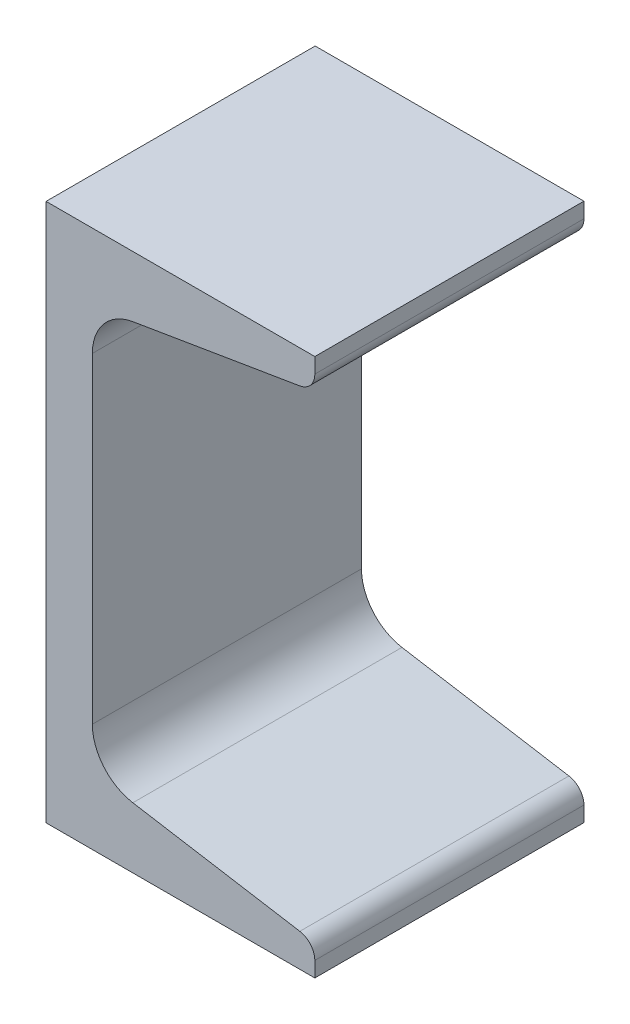
ISO-10303-21;
HEADER;
FILE_DESCRIPTION(('STEP AP214'),'2;1');
FILE_NAME('part.step','',(''),(''),'','','');
FILE_SCHEMA(('AUTOMOTIVE_DESIGN { 1 0 10303 214 1 1 1 1 }'));
ENDSEC;
DATA;
#1=APPLICATION_CONTEXT('core data for automotive mechanical design processes');
#2=APPLICATION_PROTOCOL_DEFINITION('international standard','automotive_design',2000,#1);
#3=PRODUCT_CONTEXT('',#1,'mechanical');
#4=PRODUCT('Part','Part','',(#3));
#5=PRODUCT_RELATED_PRODUCT_CATEGORY('part','',(#4));
#6=PRODUCT_DEFINITION_FORMATION('','',#4);
#7=PRODUCT_DEFINITION_CONTEXT('part definition',#1,'design');
#8=PRODUCT_DEFINITION('design','',#6,#7);
#9=PRODUCT_DEFINITION_SHAPE('','',#8);
#10=(LENGTH_UNIT() NAMED_UNIT(*) SI_UNIT(.MILLI.,.METRE.));
#11=(NAMED_UNIT(*) PLANE_ANGLE_UNIT() SI_UNIT($,.RADIAN.));
#12=(NAMED_UNIT(*) SI_UNIT($,.STERADIAN.) SOLID_ANGLE_UNIT());
#13=UNCERTAINTY_MEASURE_WITH_UNIT(LENGTH_MEASURE(1.E-05),#10,'distance_accuracy_value','');
#14=(GEOMETRIC_REPRESENTATION_CONTEXT(3) GLOBAL_UNCERTAINTY_ASSIGNED_CONTEXT((#13)) GLOBAL_UNIT_ASSIGNED_CONTEXT((#10,
#11,#12)) REPRESENTATION_CONTEXT('',''));
#15=CARTESIAN_POINT('',(0.,0.,0.));
#16=DIRECTION('',(0.,0.,1.));
#17=DIRECTION('',(1.,0.,0.));
#18=AXIS2_PLACEMENT_3D('',#15,#16,#17);
#19=CARTESIAN_POINT('',(0.,0.,19.05));
#20=DIRECTION('',(0.,1.,0.));
#21=DIRECTION('',(-1.,0.,0.));
#22=AXIS2_PLACEMENT_3D('',#19,#20,#21);
#23=PLANE('',#22);
#24=DIRECTION('',(1.,0.,0.));
#25=VECTOR('',#24,1.);
#26=CARTESIAN_POINT('',(0.,0.,-19.05));
#27=LINE('',#26,#25);
#28=CARTESIAN_POINT('',(0.,0.,-19.05));
#29=VERTEX_POINT('',#28);
#30=CARTESIAN_POINT('',(38.0492,0.,-19.05));
#31=VERTEX_POINT('',#30);
#32=EDGE_CURVE('E154',#29,#31,#27,.T.);
#33=ORIENTED_EDGE('',*,*,#32,.T.);
#34=DIRECTION('',(0.,0.,-1.));
#35=VECTOR('',#34,1.);
#36=CARTESIAN_POINT('',(38.0492,0.,19.05));
#37=LINE('',#36,#35);
#38=CARTESIAN_POINT('',(38.0492,0.,19.05));
#39=VERTEX_POINT('',#38);
#40=EDGE_CURVE('E11',#39,#31,#37,.T.);
#41=ORIENTED_EDGE('',*,*,#40,.F.);
#42=DIRECTION('',(1.,0.,0.));
#43=VECTOR('',#42,1.);
#44=CARTESIAN_POINT('',(0.,0.,19.05));
#45=LINE('',#44,#43);
#46=CARTESIAN_POINT('',(0.,0.,19.05));
#47=VERTEX_POINT('',#46);
#48=EDGE_CURVE('E176',#47,#39,#45,.T.);
#49=ORIENTED_EDGE('',*,*,#48,.F.);
#50=DIRECTION('',(0.,0.,-1.));
#51=VECTOR('',#50,1.);
#52=CARTESIAN_POINT('',(0.,0.,19.05));
#53=LINE('',#52,#51);
#54=EDGE_CURVE('E150',#47,#29,#53,.T.);
#55=ORIENTED_EDGE('',*,*,#54,.T.);
#56=EDGE_LOOP('',(#33,#41,#49,#55));
#57=FACE_BOUND('',#56,.T.);
#58=ADVANCED_FACE('F34',(#57),#23,.F.);
#59=CARTESIAN_POINT('',(38.0492,0.,19.05));
#60=DIRECTION('',(-1.,0.,0.));
#61=DIRECTION('',(0.,0.,1.));
#62=AXIS2_PLACEMENT_3D('',#59,#60,#61);
#63=PLANE('',#62);
#64=DIRECTION('',(0.,1.,0.));
#65=VECTOR('',#64,1.);
#66=CARTESIAN_POINT('',(38.0492,0.,-19.05));
#67=LINE('',#66,#65);
#68=CARTESIAN_POINT('',(38.0492,2.15766486416199,-19.05));
#69=VERTEX_POINT('',#68);
#70=EDGE_CURVE('E157',#31,#69,#67,.T.);
#71=ORIENTED_EDGE('',*,*,#70,.T.);
#72=DIRECTION('',(0.,0.,-1.));
#73=VECTOR('',#72,1.);
#74=CARTESIAN_POINT('',(38.0492,2.15766486416199,19.05));
#75=LINE('',#74,#73);
#76=CARTESIAN_POINT('',(38.0492,2.15766486416199,19.05));
#77=VERTEX_POINT('',#76);
#78=EDGE_CURVE('E42',#77,#69,#75,.T.);
#79=ORIENTED_EDGE('',*,*,#78,.F.);
#80=DIRECTION('',(0.,1.,0.));
#81=VECTOR('',#80,1.);
#82=CARTESIAN_POINT('',(38.0492,0.,19.05));
#83=LINE('',#82,#81);
#84=EDGE_CURVE('E105',#39,#77,#83,.T.);
#85=ORIENTED_EDGE('',*,*,#84,.F.);
#86=ORIENTED_EDGE('',*,*,#40,.T.);
#87=EDGE_LOOP('',(#71,#79,#85,#86));
#88=FACE_BOUND('',#87,.T.);
#89=ADVANCED_FACE('F254',(#88),#63,.F.);
#90=CARTESIAN_POINT('',(35.5092,2.15766486416199,19.05));
#91=DIRECTION('',(0.,0.,-1.));
#92=DIRECTION('',(-1.,0.,0.));
#93=AXIS2_PLACEMENT_3D('',#90,#91,#92);
#94=CYLINDRICAL_SURFACE('',#93,2.54);
#95=CARTESIAN_POINT('',(35.5092,2.15766486416199,-19.05));
#96=DIRECTION('',(0.,0.,1.));
#97=DIRECTION('',(1.,0.,0.));
#98=AXIS2_PLACEMENT_3D('',#95,#96,#97);
#99=CIRCLE('',#98,2.54);
#100=CARTESIAN_POINT('',(35.9268030663407,4.66310049075128,-19.05));
#101=VERTEX_POINT('',#100);
#102=EDGE_CURVE('E159',#69,#101,#99,.T.);
#103=ORIENTED_EDGE('',*,*,#102,.T.);
#104=DIRECTION('',(0.,0.,-1.));
#105=VECTOR('',#104,1.);
#106=CARTESIAN_POINT('',(35.9268030663407,4.66310049075128,19.05));
#107=LINE('',#106,#105);
#108=CARTESIAN_POINT('',(35.9268030663407,4.66310049075128,19.05));
#109=VERTEX_POINT('',#108);
#110=EDGE_CURVE('E195',#109,#101,#107,.T.);
#111=ORIENTED_EDGE('',*,*,#110,.F.);
#112=CARTESIAN_POINT('',(35.5092,2.15766486416199,19.05));
#113=DIRECTION('',(0.,0.,1.));
#114=DIRECTION('',(1.,0.,0.));
#115=AXIS2_PLACEMENT_3D('',#112,#113,#114);
#116=CIRCLE('',#115,2.54);
#117=EDGE_CURVE('E203',#77,#109,#116,.T.);
#118=ORIENTED_EDGE('',*,*,#117,.F.);
#119=ORIENTED_EDGE('',*,*,#78,.T.);
#120=EDGE_LOOP('',(#103,#111,#118,#119));
#121=FACE_BOUND('',#120,.T.);
#122=ADVANCED_FACE('F201',(#121),#94,.T.);
#123=CARTESIAN_POINT('',(12.2836717208802,8.60390984261646,19.05));
#124=DIRECTION('',(-0.16441065603963,-0.986391978972162,0.));
#125=DIRECTION('',(0.986391978972162,-0.16441065603963,0.));
#126=AXIS2_PLACEMENT_3D('',#123,#124,#125);
#127=PLANE('',#126);
#128=DIRECTION('',(-0.986391978972162,0.16441065603963,0.));
#129=VECTOR('',#128,1.);
#130=CARTESIAN_POINT('',(12.2836717208802,8.60390984261646,-19.05));
#131=LINE('',#130,#129);
#132=CARTESIAN_POINT('',(12.2836717208802,8.60390984261646,-19.05));
#133=VERTEX_POINT('',#132);
#134=EDGE_CURVE('E161',#101,#133,#131,.T.);
#135=ORIENTED_EDGE('',*,*,#134,.T.);
#136=DIRECTION('',(0.,0.,-1.));
#137=VECTOR('',#136,1.);
#138=CARTESIAN_POINT('',(12.2836717208802,8.60390984261646,19.05));
#139=LINE('',#138,#137);
#140=CARTESIAN_POINT('',(12.2836717208802,8.60390984261646,19.05));
#141=VERTEX_POINT('',#140);
#142=EDGE_CURVE('E192',#141,#133,#139,.T.);
#143=ORIENTED_EDGE('',*,*,#142,.F.);
#144=DIRECTION('',(-0.986391978972162,0.16441065603963,0.));
#145=VECTOR('',#144,1.);
#146=CARTESIAN_POINT('',(12.2836717208802,8.60390984261646,19.05));
#147=LINE('',#146,#145);
#148=EDGE_CURVE('E221',#109,#141,#147,.T.);
#149=ORIENTED_EDGE('',*,*,#148,.F.);
#150=ORIENTED_EDGE('',*,*,#110,.T.);
#151=EDGE_LOOP('',(#135,#143,#149,#150));
#152=FACE_BOUND('',#151,.T.);
#153=ADVANCED_FACE('F212',(#152),#127,.F.);
#154=CARTESIAN_POINT('',(13.4112,15.3685860344076,19.05));
#155=DIRECTION('',(0.,0.,-1.));
#156=DIRECTION('',(-1.,0.,0.));
#157=AXIS2_PLACEMENT_3D('',#154,#155,#156);
#158=CYLINDRICAL_SURFACE('',#157,6.858);
#159=CARTESIAN_POINT('',(13.4112,15.3685860344076,-19.05));
#160=DIRECTION('',(0.,0.,-1.));
#161=DIRECTION('',(1.,0.,0.));
#162=AXIS2_PLACEMENT_3D('',#159,#160,#161);
#163=CIRCLE('',#162,6.858);
#164=CARTESIAN_POINT('',(6.5532,15.3685860344076,-19.05));
#165=VERTEX_POINT('',#164);
#166=EDGE_CURVE('E163',#133,#165,#163,.T.);
#167=ORIENTED_EDGE('',*,*,#166,.T.);
#168=DIRECTION('',(0.,0.,-1.));
#169=VECTOR('',#168,1.);
#170=CARTESIAN_POINT('',(6.5532,15.3685860344076,19.05));
#171=LINE('',#170,#169);
#172=CARTESIAN_POINT('',(6.5532,15.3685860344076,19.05));
#173=VERTEX_POINT('',#172);
#174=EDGE_CURVE('E189',#173,#165,#171,.T.);
#175=ORIENTED_EDGE('',*,*,#174,.F.);
#176=CARTESIAN_POINT('',(13.4112,15.3685860344076,19.05));
#177=DIRECTION('',(0.,0.,-1.));
#178=DIRECTION('',(1.,0.,0.));
#179=AXIS2_PLACEMENT_3D('',#176,#177,#178);
#180=CIRCLE('',#179,6.858);
#181=EDGE_CURVE('E218',#141,#173,#180,.T.);
#182=ORIENTED_EDGE('',*,*,#181,.F.);
#183=ORIENTED_EDGE('',*,*,#142,.T.);
#184=EDGE_LOOP('',(#167,#175,#182,#183));
#185=FACE_BOUND('',#184,.T.);
#186=ADVANCED_FACE('F216',(#185),#158,.F.);
#187=CARTESIAN_POINT('',(6.55320000000001,60.8314139655924,19.05));
#188=DIRECTION('',(-1.,0.,0.));
#189=DIRECTION('',(0.,-1.,0.));
#190=AXIS2_PLACEMENT_3D('',#187,#188,#189);
#191=PLANE('',#190);
#192=DIRECTION('',(0.,1.,0.));
#193=VECTOR('',#192,1.);
#194=CARTESIAN_POINT('',(6.55320000000001,60.8314139655924,-19.05));
#195=LINE('',#194,#193);
#196=CARTESIAN_POINT('',(6.55320000000001,60.8314139655924,-19.05));
#197=VERTEX_POINT('',#196);
#198=EDGE_CURVE('E165',#165,#197,#195,.T.);
#199=ORIENTED_EDGE('',*,*,#198,.T.);
#200=DIRECTION('',(0.,0.,-1.));
#201=VECTOR('',#200,1.);
#202=CARTESIAN_POINT('',(6.55320000000001,60.8314139655924,19.05));
#203=LINE('',#202,#201);
#204=CARTESIAN_POINT('',(6.55320000000001,60.8314139655924,19.05));
#205=VERTEX_POINT('',#204);
#206=EDGE_CURVE('E186',#205,#197,#203,.T.);
#207=ORIENTED_EDGE('',*,*,#206,.F.);
#208=DIRECTION('',(0.,1.,0.));
#209=VECTOR('',#208,1.);
#210=CARTESIAN_POINT('',(6.55320000000001,60.8314139655924,19.05));
#211=LINE('',#210,#209);
#212=EDGE_CURVE('E220',#173,#205,#211,.T.);
#213=ORIENTED_EDGE('',*,*,#212,.F.);
#214=ORIENTED_EDGE('',*,*,#174,.T.);
#215=EDGE_LOOP('',(#199,#207,#213,#214));
#216=FACE_BOUND('',#215,.T.);
#217=ADVANCED_FACE('F267',(#216),#191,.F.);
#218=CARTESIAN_POINT('',(13.4112,60.8314139655924,19.05));
#219=DIRECTION('',(0.,0.,-1.));
#220=DIRECTION('',(-1.,0.,0.));
#221=AXIS2_PLACEMENT_3D('',#218,#219,#220);
#222=CYLINDRICAL_SURFACE('',#221,6.858);
#223=CARTESIAN_POINT('',(13.4112,60.8314139655924,-19.05));
#224=DIRECTION('',(0.,0.,-1.));
#225=DIRECTION('',(-1.,0.,0.));
#226=AXIS2_PLACEMENT_3D('',#223,#224,#225);
#227=CIRCLE('',#226,6.858);
#228=CARTESIAN_POINT('',(12.2836717208802,67.5960901573835,-19.05));
#229=VERTEX_POINT('',#228);
#230=EDGE_CURVE('E167',#197,#229,#227,.T.);
#231=ORIENTED_EDGE('',*,*,#230,.T.);
#232=DIRECTION('',(0.,0.,-1.));
#233=VECTOR('',#232,1.);
#234=CARTESIAN_POINT('',(12.2836717208802,67.5960901573835,19.05));
#235=LINE('',#234,#233);
#236=CARTESIAN_POINT('',(12.2836717208802,67.5960901573835,19.05));
#237=VERTEX_POINT('',#236);
#238=EDGE_CURVE('E183',#237,#229,#235,.T.);
#239=ORIENTED_EDGE('',*,*,#238,.F.);
#240=CARTESIAN_POINT('',(13.4112,60.8314139655924,19.05));
#241=DIRECTION('',(0.,0.,-1.));
#242=DIRECTION('',(-1.,0.,0.));
#243=AXIS2_PLACEMENT_3D('',#240,#241,#242);
#244=CIRCLE('',#243,6.858);
#245=EDGE_CURVE('E223',#205,#237,#244,.T.);
#246=ORIENTED_EDGE('',*,*,#245,.F.);
#247=ORIENTED_EDGE('',*,*,#206,.T.);
#248=EDGE_LOOP('',(#231,#239,#246,#247));
#249=FACE_BOUND('',#248,.T.);
#250=ADVANCED_FACE('F270',(#249),#222,.F.);
#251=CARTESIAN_POINT('',(12.2836717208802,67.5960901573835,19.05));
#252=DIRECTION('',(-0.164410656039631,0.986391978972162,0.));
#253=DIRECTION('',(-0.986391978972162,-0.164410656039631,0.));
#254=AXIS2_PLACEMENT_3D('',#251,#252,#253);
#255=PLANE('',#254);
#256=DIRECTION('',(0.986391978972162,0.164410656039631,0.));
#257=VECTOR('',#256,1.);
#258=CARTESIAN_POINT('',(12.2836717208802,67.5960901573835,-19.05));
#259=LINE('',#258,#257);
#260=CARTESIAN_POINT('',(35.9268030663407,71.5368995092487,-19.05));
#261=VERTEX_POINT('',#260);
#262=EDGE_CURVE('E169',#229,#261,#259,.T.);
#263=ORIENTED_EDGE('',*,*,#262,.T.);
#264=DIRECTION('',(0.,0.,-1.));
#265=VECTOR('',#264,1.);
#266=CARTESIAN_POINT('',(35.9268030663407,71.5368995092487,19.05));
#267=LINE('',#266,#265);
#268=CARTESIAN_POINT('',(35.9268030663407,71.5368995092487,19.05));
#269=VERTEX_POINT('',#268);
#270=EDGE_CURVE('E180',#269,#261,#267,.T.);
#271=ORIENTED_EDGE('',*,*,#270,.F.);
#272=DIRECTION('',(0.986391978972162,0.164410656039631,0.));
#273=VECTOR('',#272,1.);
#274=CARTESIAN_POINT('',(12.2836717208802,67.5960901573835,19.05));
#275=LINE('',#274,#273);
#276=EDGE_CURVE('E229',#237,#269,#275,.T.);
#277=ORIENTED_EDGE('',*,*,#276,.F.);
#278=ORIENTED_EDGE('',*,*,#238,.T.);
#279=EDGE_LOOP('',(#263,#271,#277,#278));
#280=FACE_BOUND('',#279,.T.);
#281=ADVANCED_FACE('F235',(#280),#255,.F.);
#282=CARTESIAN_POINT('',(35.5092,74.042335135838,19.05));
#283=DIRECTION('',(0.,0.,-1.));
#284=DIRECTION('',(-1.,0.,0.));
#285=AXIS2_PLACEMENT_3D('',#282,#283,#284);
#286=CYLINDRICAL_SURFACE('',#285,2.54000000000001);
#287=CARTESIAN_POINT('',(35.5092,74.042335135838,-19.05));
#288=DIRECTION('',(0.,0.,1.));
#289=DIRECTION('',(-1.,0.,0.));
#290=AXIS2_PLACEMENT_3D('',#287,#288,#289);
#291=CIRCLE('',#290,2.54000000000001);
#292=CARTESIAN_POINT('',(38.0492,74.042335135838,-19.05));
#293=VERTEX_POINT('',#292);
#294=EDGE_CURVE('E171',#261,#293,#291,.T.);
#295=ORIENTED_EDGE('',*,*,#294,.T.);
#296=DIRECTION('',(0.,0.,-1.));
#297=VECTOR('',#296,1.);
#298=CARTESIAN_POINT('',(38.0492,74.042335135838,19.05));
#299=LINE('',#298,#297);
#300=CARTESIAN_POINT('',(38.0492,74.042335135838,19.05));
#301=VERTEX_POINT('',#300);
#302=EDGE_CURVE('E145',#301,#293,#299,.T.);
#303=ORIENTED_EDGE('',*,*,#302,.F.);
#304=CARTESIAN_POINT('',(35.5092,74.042335135838,19.05));
#305=DIRECTION('',(0.,0.,1.));
#306=DIRECTION('',(-1.,0.,0.));
#307=AXIS2_PLACEMENT_3D('',#304,#305,#306);
#308=CIRCLE('',#307,2.54000000000001);
#309=EDGE_CURVE('E136',#269,#301,#308,.T.);
#310=ORIENTED_EDGE('',*,*,#309,.F.);
#311=ORIENTED_EDGE('',*,*,#270,.T.);
#312=EDGE_LOOP('',(#295,#303,#310,#311));
#313=FACE_BOUND('',#312,.T.);
#314=ADVANCED_FACE('F239',(#313),#286,.T.);
#315=CARTESIAN_POINT('',(38.0492,76.2,19.05));
#316=DIRECTION('',(-1.,0.,0.));
#317=DIRECTION('',(0.,-1.,0.));
#318=AXIS2_PLACEMENT_3D('',#315,#316,#317);
#319=PLANE('',#318);
#320=DIRECTION('',(0.,1.,0.));
#321=VECTOR('',#320,1.);
#322=CARTESIAN_POINT('',(38.0492,76.2,-19.05));
#323=LINE('',#322,#321);
#324=CARTESIAN_POINT('',(38.0492,76.2,-19.05));
#325=VERTEX_POINT('',#324);
#326=EDGE_CURVE('E144',#293,#325,#323,.T.);
#327=ORIENTED_EDGE('',*,*,#326,.T.);
#328=DIRECTION('',(0.,0.,-1.));
#329=VECTOR('',#328,1.);
#330=CARTESIAN_POINT('',(38.0492,76.2,19.05));
#331=LINE('',#330,#329);
#332=CARTESIAN_POINT('',(38.0492,76.2,19.05));
#333=VERTEX_POINT('',#332);
#334=EDGE_CURVE('E141',#333,#325,#331,.T.);
#335=ORIENTED_EDGE('',*,*,#334,.F.);
#336=DIRECTION('',(0.,1.,0.));
#337=VECTOR('',#336,1.);
#338=CARTESIAN_POINT('',(38.0492,76.2,19.05));
#339=LINE('',#338,#337);
#340=EDGE_CURVE('E130',#301,#333,#339,.T.);
#341=ORIENTED_EDGE('',*,*,#340,.F.);
#342=ORIENTED_EDGE('',*,*,#302,.T.);
#343=EDGE_LOOP('',(#327,#335,#341,#342));
#344=FACE_BOUND('',#343,.T.);
#345=ADVANCED_FACE('F142',(#344),#319,.F.);
#346=CARTESIAN_POINT('',(0.,76.2,19.05));
#347=DIRECTION('',(0.,-1.,0.));
#348=DIRECTION('',(0.,0.,-1.));
#349=AXIS2_PLACEMENT_3D('',#346,#347,#348);
#350=PLANE('',#349);
#351=DIRECTION('',(-1.,0.,0.));
#352=VECTOR('',#351,1.);
#353=CARTESIAN_POINT('',(0.,76.2,-19.05));
#354=LINE('',#353,#352);
#355=CARTESIAN_POINT('',(0.,76.2,-19.05));
#356=VERTEX_POINT('',#355);
#357=EDGE_CURVE('E91',#325,#356,#354,.T.);
#358=ORIENTED_EDGE('',*,*,#357,.T.);
#359=DIRECTION('',(0.,0.,-1.));
#360=VECTOR('',#359,1.);
#361=CARTESIAN_POINT('',(0.,76.2,19.05));
#362=LINE('',#361,#360);
#363=CARTESIAN_POINT('',(0.,76.2,19.05));
#364=VERTEX_POINT('',#363);
#365=EDGE_CURVE('E146',#364,#356,#362,.T.);
#366=ORIENTED_EDGE('',*,*,#365,.F.);
#367=DIRECTION('',(-1.,0.,0.));
#368=VECTOR('',#367,1.);
#369=CARTESIAN_POINT('',(0.,76.2,19.05));
#370=LINE('',#369,#368);
#371=EDGE_CURVE('E134',#333,#364,#370,.T.);
#372=ORIENTED_EDGE('',*,*,#371,.F.);
#373=ORIENTED_EDGE('',*,*,#334,.T.);
#374=EDGE_LOOP('',(#358,#366,#372,#373));
#375=FACE_BOUND('',#374,.T.);
#376=ADVANCED_FACE('F148',(#375),#350,.F.);
#377=CARTESIAN_POINT('',(0.,0.,19.05));
#378=DIRECTION('',(1.,0.,0.));
#379=DIRECTION('',(0.,1.,0.));
#380=AXIS2_PLACEMENT_3D('',#377,#378,#379);
#381=PLANE('',#380);
#382=DIRECTION('',(0.,-1.,0.));
#383=VECTOR('',#382,1.);
#384=CARTESIAN_POINT('',(0.,0.,-19.05));
#385=LINE('',#384,#383);
#386=EDGE_CURVE('E97',#356,#29,#385,.T.);
#387=ORIENTED_EDGE('',*,*,#386,.T.);
#388=ORIENTED_EDGE('',*,*,#54,.F.);
#389=DIRECTION('',(0.,-1.,0.));
#390=VECTOR('',#389,1.);
#391=CARTESIAN_POINT('',(0.,0.,19.05));
#392=LINE('',#391,#390);
#393=EDGE_CURVE('E50',#364,#47,#392,.T.);
#394=ORIENTED_EDGE('',*,*,#393,.F.);
#395=ORIENTED_EDGE('',*,*,#365,.T.);
#396=EDGE_LOOP('',(#387,#388,#394,#395));
#397=FACE_BOUND('',#396,.T.);
#398=ADVANCED_FACE('F243',(#397),#381,.F.);
#399=CARTESIAN_POINT('',(35.5092,2.15766486416199,19.05));
#400=DIRECTION('',(0.,0.,1.));
#401=DIRECTION('',(1.,0.,0.));
#402=AXIS2_PLACEMENT_3D('',#399,#400,#401);
#403=PLANE('',#402);
#404=ORIENTED_EDGE('',*,*,#48,.T.);
#405=ORIENTED_EDGE('',*,*,#84,.T.);
#406=ORIENTED_EDGE('',*,*,#117,.T.);
#407=ORIENTED_EDGE('',*,*,#148,.T.);
#408=ORIENTED_EDGE('',*,*,#181,.T.);
#409=ORIENTED_EDGE('',*,*,#212,.T.);
#410=ORIENTED_EDGE('',*,*,#245,.T.);
#411=ORIENTED_EDGE('',*,*,#276,.T.);
#412=ORIENTED_EDGE('',*,*,#309,.T.);
#413=ORIENTED_EDGE('',*,*,#340,.T.);
#414=ORIENTED_EDGE('',*,*,#371,.T.);
#415=ORIENTED_EDGE('',*,*,#393,.T.);
#416=EDGE_LOOP('',(#404,#405,#406,#407,#408,#409,#410,#411,#412,#413,#414,#415));
#417=FACE_BOUND('',#416,.T.);
#418=ADVANCED_FACE('F132',(#417),#403,.T.);
#419=CARTESIAN_POINT('',(35.5092,2.15766486416199,-19.05));
#420=DIRECTION('',(0.,0.,1.));
#421=DIRECTION('',(1.,0.,0.));
#422=AXIS2_PLACEMENT_3D('',#419,#420,#421);
#423=PLANE('',#422);
#424=ORIENTED_EDGE('',*,*,#32,.F.);
#425=ORIENTED_EDGE('',*,*,#386,.F.);
#426=ORIENTED_EDGE('',*,*,#357,.F.);
#427=ORIENTED_EDGE('',*,*,#326,.F.);
#428=ORIENTED_EDGE('',*,*,#294,.F.);
#429=ORIENTED_EDGE('',*,*,#262,.F.);
#430=ORIENTED_EDGE('',*,*,#230,.F.);
#431=ORIENTED_EDGE('',*,*,#198,.F.);
#432=ORIENTED_EDGE('',*,*,#166,.F.);
#433=ORIENTED_EDGE('',*,*,#134,.F.);
#434=ORIENTED_EDGE('',*,*,#102,.F.);
#435=ORIENTED_EDGE('',*,*,#70,.F.);
#436=EDGE_LOOP('',(#424,#425,#426,#427,#428,#429,#430,#431,#432,#433,#434,#435));
#437=FACE_BOUND('',#436,.T.);
#438=ADVANCED_FACE('F207',(#437),#423,.F.);
#439=CLOSED_SHELL('',(#58,#89,#122,#153,#186,#217,#250,#281,#314,#345,#376,#398,#418,#438));
#440=MANIFOLD_SOLID_BREP('B2',#439);
#441=ADVANCED_BREP_SHAPE_REPRESENTATION('',(#18,#440),#14);
#442=SHAPE_DEFINITION_REPRESENTATION(#9,#441);
ENDSEC;
END-ISO-10303-21;
